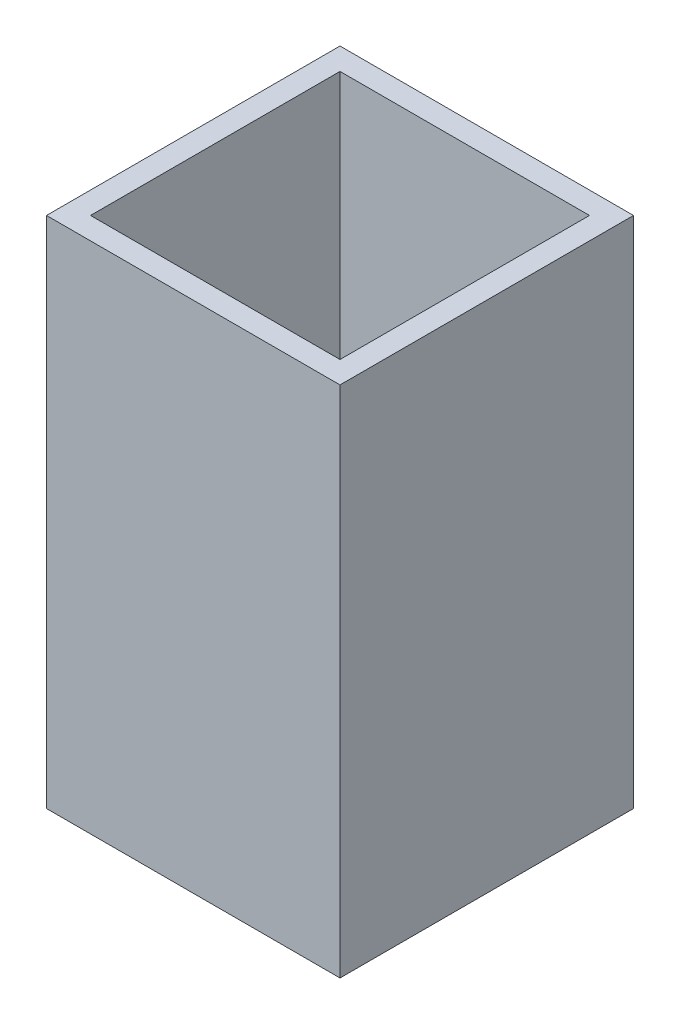
ISO-10303-21;
HEADER;
FILE_DESCRIPTION(('STEP AP214'),'2;1');
FILE_NAME('part.step','',(''),(''),'','','');
FILE_SCHEMA(('AUTOMOTIVE_DESIGN { 1 0 10303 214 1 1 1 1 }'));
ENDSEC;
DATA;
#1=APPLICATION_CONTEXT('core data for automotive mechanical design processes');
#2=APPLICATION_PROTOCOL_DEFINITION('international standard','automotive_design',2000,#1);
#3=PRODUCT_CONTEXT('',#1,'mechanical');
#4=PRODUCT('Part','Part','',(#3));
#5=PRODUCT_RELATED_PRODUCT_CATEGORY('part','',(#4));
#6=PRODUCT_DEFINITION_FORMATION('','',#4);
#7=PRODUCT_DEFINITION_CONTEXT('part definition',#1,'design');
#8=PRODUCT_DEFINITION('design','',#6,#7);
#9=PRODUCT_DEFINITION_SHAPE('','',#8);
#10=(LENGTH_UNIT() NAMED_UNIT(*) SI_UNIT(.MILLI.,.METRE.));
#11=(NAMED_UNIT(*) PLANE_ANGLE_UNIT() SI_UNIT($,.RADIAN.));
#12=(NAMED_UNIT(*) SI_UNIT($,.STERADIAN.) SOLID_ANGLE_UNIT());
#13=UNCERTAINTY_MEASURE_WITH_UNIT(LENGTH_MEASURE(1.E-05),#10,'distance_accuracy_value','');
#14=(GEOMETRIC_REPRESENTATION_CONTEXT(3) GLOBAL_UNCERTAINTY_ASSIGNED_CONTEXT((#13)) GLOBAL_UNIT_ASSIGNED_CONTEXT((#10,
#11,#12)) REPRESENTATION_CONTEXT('',''));
#15=CARTESIAN_POINT('',(0.,0.,0.));
#16=DIRECTION('',(0.,0.,1.));
#17=DIRECTION('',(1.,0.,0.));
#18=AXIS2_PLACEMENT_3D('',#15,#16,#17);
#19=CARTESIAN_POINT('',(0.,35.,0.));
#20=DIRECTION('',(0.,-1.,0.));
#21=DIRECTION('',(0.,0.,-1.));
#22=AXIS2_PLACEMENT_3D('',#19,#20,#21);
#23=PLANE('',#22);
#24=DIRECTION('',(0.,0.,-1.));
#25=VECTOR('',#24,1.);
#26=CARTESIAN_POINT('',(10.,35.,10.));
#27=LINE('',#26,#25);
#28=CARTESIAN_POINT('',(10.,35.,10.));
#29=VERTEX_POINT('',#28);
#30=CARTESIAN_POINT('',(10.,35.,-10.));
#31=VERTEX_POINT('',#30);
#32=EDGE_CURVE('E137',#29,#31,#27,.T.);
#33=ORIENTED_EDGE('',*,*,#32,.T.);
#34=DIRECTION('',(-1.,0.,0.));
#35=VECTOR('',#34,1.);
#36=CARTESIAN_POINT('',(-10.,35.,-10.));
#37=LINE('',#36,#35);
#38=CARTESIAN_POINT('',(-10.,35.,-10.));
#39=VERTEX_POINT('',#38);
#40=EDGE_CURVE('E140',#31,#39,#37,.T.);
#41=ORIENTED_EDGE('',*,*,#40,.T.);
#42=DIRECTION('',(0.,0.,1.));
#43=VECTOR('',#42,1.);
#44=CARTESIAN_POINT('',(-10.,35.,10.));
#45=LINE('',#44,#43);
#46=CARTESIAN_POINT('',(-10.,35.,10.));
#47=VERTEX_POINT('',#46);
#48=EDGE_CURVE('E143',#39,#47,#45,.T.);
#49=ORIENTED_EDGE('',*,*,#48,.T.);
#50=DIRECTION('',(1.,0.,0.));
#51=VECTOR('',#50,1.);
#52=CARTESIAN_POINT('',(-10.,35.,10.));
#53=LINE('',#52,#51);
#54=EDGE_CURVE('E145',#47,#29,#53,.T.);
#55=ORIENTED_EDGE('',*,*,#54,.T.);
#56=EDGE_LOOP('',(#33,#41,#49,#55));
#57=FACE_BOUND('',#56,.T.);
#58=DIRECTION('',(0.,0.,1.));
#59=VECTOR('',#58,1.);
#60=CARTESIAN_POINT('',(-8.5,35.,8.5));
#61=LINE('',#60,#59);
#62=CARTESIAN_POINT('',(-8.5,35.,-8.5));
#63=VERTEX_POINT('',#62);
#64=CARTESIAN_POINT('',(-8.5,35.,8.5));
#65=VERTEX_POINT('',#64);
#66=EDGE_CURVE('E101',#63,#65,#61,.T.);
#67=ORIENTED_EDGE('',*,*,#66,.F.);
#68=DIRECTION('',(-1.,0.,0.));
#69=VECTOR('',#68,1.);
#70=CARTESIAN_POINT('',(-8.5,35.,-8.5));
#71=LINE('',#70,#69);
#72=CARTESIAN_POINT('',(8.5,35.,-8.5));
#73=VERTEX_POINT('',#72);
#74=EDGE_CURVE('E123',#73,#63,#71,.T.);
#75=ORIENTED_EDGE('',*,*,#74,.F.);
#76=DIRECTION('',(0.,0.,-1.));
#77=VECTOR('',#76,1.);
#78=CARTESIAN_POINT('',(8.5,35.,8.5));
#79=LINE('',#78,#77);
#80=CARTESIAN_POINT('',(8.5,35.,8.5));
#81=VERTEX_POINT('',#80);
#82=EDGE_CURVE('E121',#81,#73,#79,.T.);
#83=ORIENTED_EDGE('',*,*,#82,.F.);
#84=DIRECTION('',(1.,0.,0.));
#85=VECTOR('',#84,1.);
#86=CARTESIAN_POINT('',(-8.5,35.,8.5));
#87=LINE('',#86,#85);
#88=EDGE_CURVE('E109',#65,#81,#87,.T.);
#89=ORIENTED_EDGE('',*,*,#88,.F.);
#90=EDGE_LOOP('',(#67,#75,#83,#89));
#91=FACE_BOUND('',#90,.T.);
#92=ADVANCED_FACE('F36',(#57,#91),#23,.F.);
#93=CARTESIAN_POINT('',(0.,0.,0.));
#94=DIRECTION('',(0.,-1.,0.));
#95=DIRECTION('',(0.,0.,-1.));
#96=AXIS2_PLACEMENT_3D('',#93,#94,#95);
#97=PLANE('',#96);
#98=DIRECTION('',(0.,0.,-1.));
#99=VECTOR('',#98,1.);
#100=CARTESIAN_POINT('',(10.,0.,10.));
#101=LINE('',#100,#99);
#102=CARTESIAN_POINT('',(10.,0.,10.));
#103=VERTEX_POINT('',#102);
#104=CARTESIAN_POINT('',(10.,0.,-10.));
#105=VERTEX_POINT('',#104);
#106=EDGE_CURVE('E117',#103,#105,#101,.T.);
#107=ORIENTED_EDGE('',*,*,#106,.F.);
#108=DIRECTION('',(1.,0.,0.));
#109=VECTOR('',#108,1.);
#110=CARTESIAN_POINT('',(-10.,0.,10.));
#111=LINE('',#110,#109);
#112=CARTESIAN_POINT('',(-10.,0.,10.));
#113=VERTEX_POINT('',#112);
#114=EDGE_CURVE('E141',#113,#103,#111,.T.);
#115=ORIENTED_EDGE('',*,*,#114,.F.);
#116=DIRECTION('',(0.,0.,1.));
#117=VECTOR('',#116,1.);
#118=CARTESIAN_POINT('',(-10.,0.,10.));
#119=LINE('',#118,#117);
#120=CARTESIAN_POINT('',(-10.,0.,-10.));
#121=VERTEX_POINT('',#120);
#122=EDGE_CURVE('E152',#121,#113,#119,.T.);
#123=ORIENTED_EDGE('',*,*,#122,.F.);
#124=DIRECTION('',(-1.,0.,0.));
#125=VECTOR('',#124,1.);
#126=CARTESIAN_POINT('',(-10.,0.,-10.));
#127=LINE('',#126,#125);
#128=EDGE_CURVE('E150',#105,#121,#127,.T.);
#129=ORIENTED_EDGE('',*,*,#128,.F.);
#130=EDGE_LOOP('',(#107,#115,#123,#129));
#131=FACE_BOUND('',#130,.T.);
#132=DIRECTION('',(-1.,0.,0.));
#133=VECTOR('',#132,1.);
#134=CARTESIAN_POINT('',(-8.5,0.,-8.5));
#135=LINE('',#134,#133);
#136=CARTESIAN_POINT('',(8.5,0.,-8.5));
#137=VERTEX_POINT('',#136);
#138=CARTESIAN_POINT('',(-8.5,0.,-8.5));
#139=VERTEX_POINT('',#138);
#140=EDGE_CURVE('E110',#137,#139,#135,.T.);
#141=ORIENTED_EDGE('',*,*,#140,.T.);
#142=DIRECTION('',(0.,0.,1.));
#143=VECTOR('',#142,1.);
#144=CARTESIAN_POINT('',(-8.5,0.,8.5));
#145=LINE('',#144,#143);
#146=CARTESIAN_POINT('',(-8.5,0.,8.5));
#147=VERTEX_POINT('',#146);
#148=EDGE_CURVE('E59',#139,#147,#145,.T.);
#149=ORIENTED_EDGE('',*,*,#148,.T.);
#150=DIRECTION('',(1.,0.,0.));
#151=VECTOR('',#150,1.);
#152=CARTESIAN_POINT('',(-8.5,0.,8.5));
#153=LINE('',#152,#151);
#154=CARTESIAN_POINT('',(8.5,0.,8.5));
#155=VERTEX_POINT('',#154);
#156=EDGE_CURVE('E116',#147,#155,#153,.T.);
#157=ORIENTED_EDGE('',*,*,#156,.T.);
#158=DIRECTION('',(0.,0.,-1.));
#159=VECTOR('',#158,1.);
#160=CARTESIAN_POINT('',(8.5,0.,8.5));
#161=LINE('',#160,#159);
#162=EDGE_CURVE('E129',#155,#137,#161,.T.);
#163=ORIENTED_EDGE('',*,*,#162,.T.);
#164=EDGE_LOOP('',(#141,#149,#157,#163));
#165=FACE_BOUND('',#164,.T.);
#166=ADVANCED_FACE('F170',(#131,#165),#97,.T.);
#167=CARTESIAN_POINT('',(10.,35.,10.));
#168=DIRECTION('',(-1.,0.,0.));
#169=DIRECTION('',(0.,0.,1.));
#170=AXIS2_PLACEMENT_3D('',#167,#168,#169);
#171=PLANE('',#170);
#172=ORIENTED_EDGE('',*,*,#106,.T.);
#173=DIRECTION('',(0.,-1.,0.));
#174=VECTOR('',#173,1.);
#175=CARTESIAN_POINT('',(10.,35.,-10.));
#176=LINE('',#175,#174);
#177=EDGE_CURVE('E11',#31,#105,#176,.T.);
#178=ORIENTED_EDGE('',*,*,#177,.F.);
#179=ORIENTED_EDGE('',*,*,#32,.F.);
#180=DIRECTION('',(0.,-1.,0.));
#181=VECTOR('',#180,1.);
#182=CARTESIAN_POINT('',(10.,35.,10.));
#183=LINE('',#182,#181);
#184=EDGE_CURVE('E147',#29,#103,#183,.T.);
#185=ORIENTED_EDGE('',*,*,#184,.T.);
#186=EDGE_LOOP('',(#172,#178,#179,#185));
#187=FACE_BOUND('',#186,.T.);
#188=ADVANCED_FACE('F38',(#187),#171,.F.);
#189=CARTESIAN_POINT('',(-10.,35.,-10.));
#190=DIRECTION('',(0.,0.,1.));
#191=DIRECTION('',(1.,0.,0.));
#192=AXIS2_PLACEMENT_3D('',#189,#190,#191);
#193=PLANE('',#192);
#194=ORIENTED_EDGE('',*,*,#128,.T.);
#195=DIRECTION('',(0.,-1.,0.));
#196=VECTOR('',#195,1.);
#197=CARTESIAN_POINT('',(-10.,35.,-10.));
#198=LINE('',#197,#196);
#199=EDGE_CURVE('E44',#39,#121,#198,.T.);
#200=ORIENTED_EDGE('',*,*,#199,.F.);
#201=ORIENTED_EDGE('',*,*,#40,.F.);
#202=ORIENTED_EDGE('',*,*,#177,.T.);
#203=EDGE_LOOP('',(#194,#200,#201,#202));
#204=FACE_BOUND('',#203,.T.);
#205=ADVANCED_FACE('F180',(#204),#193,.F.);
#206=CARTESIAN_POINT('',(-10.,35.,10.));
#207=DIRECTION('',(1.,0.,0.));
#208=DIRECTION('',(0.,0.,-1.));
#209=AXIS2_PLACEMENT_3D('',#206,#207,#208);
#210=PLANE('',#209);
#211=ORIENTED_EDGE('',*,*,#122,.T.);
#212=DIRECTION('',(0.,-1.,0.));
#213=VECTOR('',#212,1.);
#214=CARTESIAN_POINT('',(-10.,35.,10.));
#215=LINE('',#214,#213);
#216=EDGE_CURVE('E157',#47,#113,#215,.T.);
#217=ORIENTED_EDGE('',*,*,#216,.F.);
#218=ORIENTED_EDGE('',*,*,#48,.F.);
#219=ORIENTED_EDGE('',*,*,#199,.T.);
#220=EDGE_LOOP('',(#211,#217,#218,#219));
#221=FACE_BOUND('',#220,.T.);
#222=ADVANCED_FACE('F164',(#221),#210,.F.);
#223=CARTESIAN_POINT('',(-10.,35.,10.));
#224=DIRECTION('',(0.,0.,-1.));
#225=DIRECTION('',(-1.,0.,0.));
#226=AXIS2_PLACEMENT_3D('',#223,#224,#225);
#227=PLANE('',#226);
#228=ORIENTED_EDGE('',*,*,#114,.T.);
#229=ORIENTED_EDGE('',*,*,#184,.F.);
#230=ORIENTED_EDGE('',*,*,#54,.F.);
#231=ORIENTED_EDGE('',*,*,#216,.T.);
#232=EDGE_LOOP('',(#228,#229,#230,#231));
#233=FACE_BOUND('',#232,.T.);
#234=ADVANCED_FACE('F174',(#233),#227,.F.);
#235=CARTESIAN_POINT('',(-8.5,35.,8.5));
#236=DIRECTION('',(1.,0.,0.));
#237=DIRECTION('',(0.,0.,-1.));
#238=AXIS2_PLACEMENT_3D('',#235,#236,#237);
#239=PLANE('',#238);
#240=ORIENTED_EDGE('',*,*,#148,.F.);
#241=DIRECTION('',(0.,-1.,0.));
#242=VECTOR('',#241,1.);
#243=CARTESIAN_POINT('',(-8.5,35.,-8.5));
#244=LINE('',#243,#242);
#245=EDGE_CURVE('E105',#63,#139,#244,.T.);
#246=ORIENTED_EDGE('',*,*,#245,.F.);
#247=ORIENTED_EDGE('',*,*,#66,.T.);
#248=DIRECTION('',(0.,-1.,0.));
#249=VECTOR('',#248,1.);
#250=CARTESIAN_POINT('',(-8.5,35.,8.5));
#251=LINE('',#250,#249);
#252=EDGE_CURVE('E104',#65,#147,#251,.T.);
#253=ORIENTED_EDGE('',*,*,#252,.T.);
#254=EDGE_LOOP('',(#240,#246,#247,#253));
#255=FACE_BOUND('',#254,.T.);
#256=ADVANCED_FACE('F103',(#255),#239,.T.);
#257=CARTESIAN_POINT('',(-8.5,35.,8.5));
#258=DIRECTION('',(0.,0.,-1.));
#259=DIRECTION('',(-1.,0.,0.));
#260=AXIS2_PLACEMENT_3D('',#257,#258,#259);
#261=PLANE('',#260);
#262=ORIENTED_EDGE('',*,*,#156,.F.);
#263=ORIENTED_EDGE('',*,*,#252,.F.);
#264=ORIENTED_EDGE('',*,*,#88,.T.);
#265=DIRECTION('',(0.,-1.,0.));
#266=VECTOR('',#265,1.);
#267=CARTESIAN_POINT('',(8.5,35.,8.5));
#268=LINE('',#267,#266);
#269=EDGE_CURVE('E118',#81,#155,#268,.T.);
#270=ORIENTED_EDGE('',*,*,#269,.T.);
#271=EDGE_LOOP('',(#262,#263,#264,#270));
#272=FACE_BOUND('',#271,.T.);
#273=ADVANCED_FACE('F113',(#272),#261,.T.);
#274=CARTESIAN_POINT('',(8.5,35.,8.5));
#275=DIRECTION('',(-1.,0.,0.));
#276=DIRECTION('',(0.,0.,1.));
#277=AXIS2_PLACEMENT_3D('',#274,#275,#276);
#278=PLANE('',#277);
#279=ORIENTED_EDGE('',*,*,#162,.F.);
#280=ORIENTED_EDGE('',*,*,#269,.F.);
#281=ORIENTED_EDGE('',*,*,#82,.T.);
#282=DIRECTION('',(0.,-1.,0.));
#283=VECTOR('',#282,1.);
#284=CARTESIAN_POINT('',(8.5,35.,-8.5));
#285=LINE('',#284,#283);
#286=EDGE_CURVE('E51',#73,#137,#285,.T.);
#287=ORIENTED_EDGE('',*,*,#286,.T.);
#288=EDGE_LOOP('',(#279,#280,#281,#287));
#289=FACE_BOUND('',#288,.T.);
#290=ADVANCED_FACE('F203',(#289),#278,.T.);
#291=CARTESIAN_POINT('',(-8.5,35.,-8.5));
#292=DIRECTION('',(0.,0.,1.));
#293=DIRECTION('',(1.,0.,0.));
#294=AXIS2_PLACEMENT_3D('',#291,#292,#293);
#295=PLANE('',#294);
#296=ORIENTED_EDGE('',*,*,#140,.F.);
#297=ORIENTED_EDGE('',*,*,#286,.F.);
#298=ORIENTED_EDGE('',*,*,#74,.T.);
#299=ORIENTED_EDGE('',*,*,#245,.T.);
#300=EDGE_LOOP('',(#296,#297,#298,#299));
#301=FACE_BOUND('',#300,.T.);
#302=ADVANCED_FACE('F207',(#301),#295,.T.);
#303=CLOSED_SHELL('',(#92,#166,#188,#205,#222,#234,#256,#273,#290,#302));
#304=MANIFOLD_SOLID_BREP('B2',#303);
#305=ADVANCED_BREP_SHAPE_REPRESENTATION('',(#18,#304),#14);
#306=SHAPE_DEFINITION_REPRESENTATION(#9,#305);
ENDSEC;
END-ISO-10303-21;
